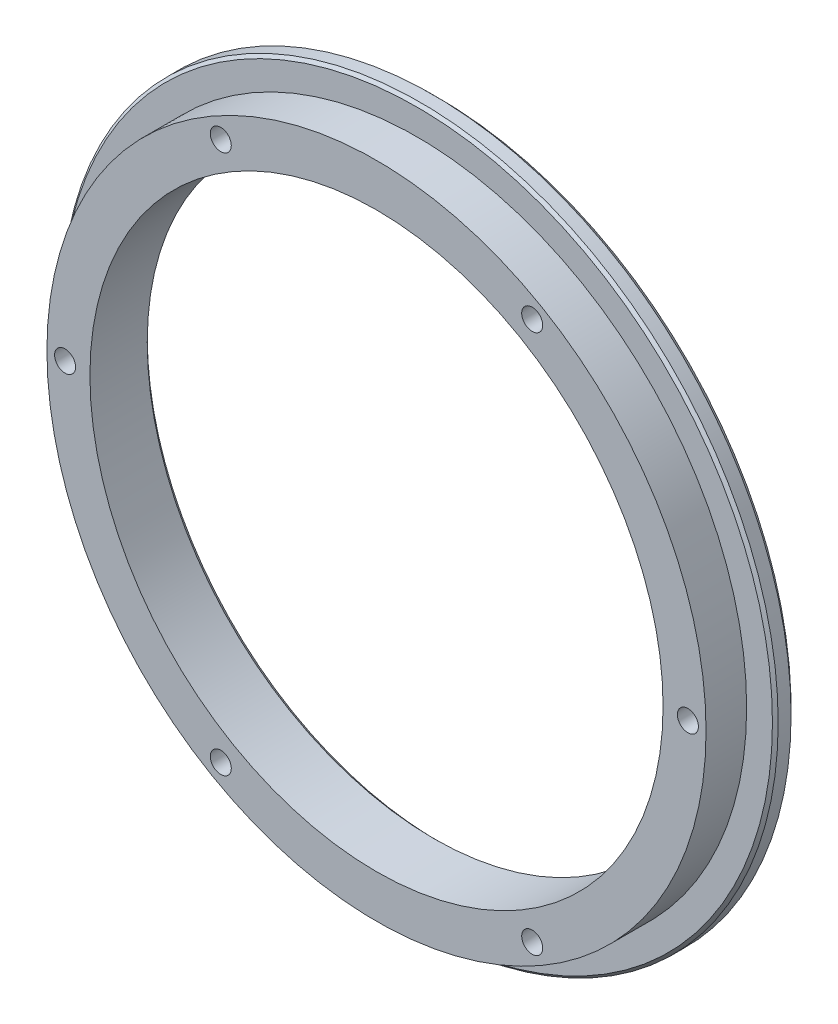
ISO-10303-21;
HEADER;
FILE_DESCRIPTION(('STEP AP214'),'2;1');
FILE_NAME('part.step','',(''),(''),'','','');
FILE_SCHEMA(('AUTOMOTIVE_DESIGN { 1 0 10303 214 1 1 1 1 }'));
ENDSEC;
DATA;
#1=APPLICATION_CONTEXT('core data for automotive mechanical design processes');
#2=APPLICATION_PROTOCOL_DEFINITION('international standard','automotive_design',2000,#1);
#3=PRODUCT_CONTEXT('',#1,'mechanical');
#4=PRODUCT('Part','Part','',(#3));
#5=PRODUCT_RELATED_PRODUCT_CATEGORY('part','',(#4));
#6=PRODUCT_DEFINITION_FORMATION('','',#4);
#7=PRODUCT_DEFINITION_CONTEXT('part definition',#1,'design');
#8=PRODUCT_DEFINITION('design','',#6,#7);
#9=PRODUCT_DEFINITION_SHAPE('','',#8);
#10=(LENGTH_UNIT() NAMED_UNIT(*) SI_UNIT(.MILLI.,.METRE.));
#11=(NAMED_UNIT(*) PLANE_ANGLE_UNIT() SI_UNIT($,.RADIAN.));
#12=(NAMED_UNIT(*) SI_UNIT($,.STERADIAN.) SOLID_ANGLE_UNIT());
#13=UNCERTAINTY_MEASURE_WITH_UNIT(LENGTH_MEASURE(1.E-05),#10,'distance_accuracy_value','');
#14=(GEOMETRIC_REPRESENTATION_CONTEXT(3) GLOBAL_UNCERTAINTY_ASSIGNED_CONTEXT((#13)) GLOBAL_UNIT_ASSIGNED_CONTEXT((#10,
#11,#12)) REPRESENTATION_CONTEXT('',''));
#15=CARTESIAN_POINT('',(0.,0.,0.));
#16=DIRECTION('',(0.,0.,1.));
#17=DIRECTION('',(1.,0.,0.));
#18=AXIS2_PLACEMENT_3D('',#15,#16,#17);
#19=CARTESIAN_POINT('',(0.,0.,-12.7));
#20=DIRECTION('',(0.,0.,1.));
#21=DIRECTION('',(-1.,0.,0.));
#22=AXIS2_PLACEMENT_3D('',#19,#20,#21);
#23=PLANE('',#22);
#24=CARTESIAN_POINT('',(0.,0.,-12.7));
#25=DIRECTION('',(0.,0.,-1.));
#26=DIRECTION('',(-1.,0.,0.));
#27=AXIS2_PLACEMENT_3D('',#24,#25,#26);
#28=CIRCLE('',#27,46.863);
#29=CARTESIAN_POINT('',(-46.863,0.,-12.7));
#30=VERTEX_POINT('',#29);
#31=EDGE_CURVE('E43',#30,#30,#28,.F.);
#32=ORIENTED_EDGE('',*,*,#31,.F.);
#33=EDGE_LOOP('',(#32));
#34=FACE_BOUND('',#33,.T.);
#35=CARTESIAN_POINT('',(0.,0.,-12.7));
#36=DIRECTION('',(0.,0.,-1.));
#37=DIRECTION('',(-1.,0.,0.));
#38=AXIS2_PLACEMENT_3D('',#35,#36,#37);
#39=CIRCLE('',#38,38.735);
#40=CARTESIAN_POINT('',(19.3674999999999,33.5454940155903,-12.7));
#41=VERTEX_POINT('',#40);
#42=CARTESIAN_POINT('',(38.735,0.,-12.7));
#43=VERTEX_POINT('',#42);
#44=EDGE_CURVE('E78',#41,#43,#39,.T.);
#45=ORIENTED_EDGE('',*,*,#44,.F.);
#46=CARTESIAN_POINT('',(20.701,35.8551837674834,-12.7));
#47=DIRECTION('',(0.,0.,1.));
#48=DIRECTION('',(1.,0.,0.));
#49=AXIS2_PLACEMENT_3D('',#46,#47,#48);
#50=CIRCLE('',#49,2.667);
#51=EDGE_CURVE('E256',#41,#41,#50,.T.);
#52=ORIENTED_EDGE('',*,*,#51,.T.);
#53=CARTESIAN_POINT('',(-19.3675000000002,33.5454940155901,-12.7));
#54=VERTEX_POINT('',#53);
#55=EDGE_CURVE('E279',#54,#41,#39,.T.);
#56=ORIENTED_EDGE('',*,*,#55,.F.);
#57=CARTESIAN_POINT('',(-20.701,35.8551837674833,-12.7));
#58=DIRECTION('',(0.,0.,1.));
#59=DIRECTION('',(1.,0.,0.));
#60=AXIS2_PLACEMENT_3D('',#57,#58,#59);
#61=CIRCLE('',#60,2.667);
#62=EDGE_CURVE('E263',#54,#54,#61,.T.);
#63=ORIENTED_EDGE('',*,*,#62,.T.);
#64=CARTESIAN_POINT('',(-38.735,0.,-12.7));
#65=VERTEX_POINT('',#64);
#66=EDGE_CURVE('E107',#65,#54,#39,.T.);
#67=ORIENTED_EDGE('',*,*,#66,.F.);
#68=CARTESIAN_POINT('',(-41.402,0.,-12.7));
#69=DIRECTION('',(0.,0.,1.));
#70=DIRECTION('',(1.,0.,0.));
#71=AXIS2_PLACEMENT_3D('',#68,#69,#70);
#72=CIRCLE('',#71,2.667);
#73=EDGE_CURVE('E270',#65,#65,#72,.T.);
#74=ORIENTED_EDGE('',*,*,#73,.T.);
#75=CARTESIAN_POINT('',(-19.3674999999998,-33.5454940155904,-12.7));
#76=VERTEX_POINT('',#75);
#77=EDGE_CURVE('E74',#76,#65,#39,.T.);
#78=ORIENTED_EDGE('',*,*,#77,.F.);
#79=CARTESIAN_POINT('',(-20.701,-35.8551837674834,-12.7));
#80=DIRECTION('',(0.,0.,1.));
#81=DIRECTION('',(1.,0.,0.));
#82=AXIS2_PLACEMENT_3D('',#79,#80,#81);
#83=CIRCLE('',#82,2.667);
#84=EDGE_CURVE('E80',#76,#76,#83,.T.);
#85=ORIENTED_EDGE('',*,*,#84,.T.);
#86=CARTESIAN_POINT('',(19.3675000000002,-33.5454940155901,-12.7));
#87=VERTEX_POINT('',#86);
#88=EDGE_CURVE('E69',#87,#76,#39,.T.);
#89=ORIENTED_EDGE('',*,*,#88,.F.);
#90=CARTESIAN_POINT('',(20.701,-35.8551837674833,-12.7));
#91=DIRECTION('',(0.,0.,1.));
#92=DIRECTION('',(1.,0.,0.));
#93=AXIS2_PLACEMENT_3D('',#90,#91,#92);
#94=CIRCLE('',#93,2.667);
#95=EDGE_CURVE('E246',#87,#87,#94,.T.);
#96=ORIENTED_EDGE('',*,*,#95,.T.);
#97=EDGE_CURVE('E56',#43,#87,#39,.T.);
#98=ORIENTED_EDGE('',*,*,#97,.F.);
#99=CARTESIAN_POINT('',(41.402,0.,-12.7));
#100=DIRECTION('',(0.,0.,1.));
#101=DIRECTION('',(1.,0.,0.));
#102=AXIS2_PLACEMENT_3D('',#99,#100,#101);
#103=CIRCLE('',#102,2.667);
#104=EDGE_CURVE('E50',#43,#43,#103,.T.);
#105=ORIENTED_EDGE('',*,*,#104,.T.);
#106=EDGE_LOOP('',(#45,#52,#56,#63,#67,#74,#78,#85,#89,#96,#98,#105));
#107=FACE_BOUND('',#106,.T.);
#108=ADVANCED_FACE('F35',(#34,#107),#23,.F.);
#109=CARTESIAN_POINT('',(0.,0.,-4.445));
#110=DIRECTION('',(0.,0.,-1.));
#111=DIRECTION('',(1.,0.,0.));
#112=AXIS2_PLACEMENT_3D('',#109,#110,#111);
#113=CYLINDRICAL_SURFACE('',#112,47.625);
#114=CARTESIAN_POINT('',(0.,0.,-11.938));
#115=DIRECTION('',(0.,0.,-1.));
#116=DIRECTION('',(-1.,0.,0.));
#117=AXIS2_PLACEMENT_3D('',#114,#115,#116);
#118=CIRCLE('',#117,47.625);
#119=CARTESIAN_POINT('',(-47.625,0.,-11.938));
#120=VERTEX_POINT('',#119);
#121=EDGE_CURVE('E11',#120,#120,#118,.T.);
#122=ORIENTED_EDGE('',*,*,#121,.F.);
#123=EDGE_LOOP('',(#122));
#124=FACE_BOUND('',#123,.T.);
#125=CARTESIAN_POINT('',(0.,0.,-10.2235));
#126=DIRECTION('',(0.,0.,1.));
#127=DIRECTION('',(1.,0.,0.));
#128=AXIS2_PLACEMENT_3D('',#125,#126,#127);
#129=CIRCLE('',#128,47.625);
#130=CARTESIAN_POINT('',(47.625,0.,-10.2235));
#131=VERTEX_POINT('',#130);
#132=EDGE_CURVE('E110',#131,#131,#129,.T.);
#133=ORIENTED_EDGE('',*,*,#132,.F.);
#134=EDGE_LOOP('',(#133));
#135=FACE_BOUND('',#134,.T.);
#136=ADVANCED_FACE('F117',(#124,#135),#113,.T.);
#137=CARTESIAN_POINT('',(0.,0.,-4.445));
#138=DIRECTION('',(0.,0.,1.));
#139=DIRECTION('',(-1.,0.,0.));
#140=AXIS2_PLACEMENT_3D('',#137,#138,#139);
#141=PLANE('',#140);
#142=CARTESIAN_POINT('',(41.402,0.,-4.445));
#143=DIRECTION('',(0.,0.,-1.));
#144=DIRECTION('',(-1.,0.,0.));
#145=AXIS2_PLACEMENT_3D('',#142,#143,#144);
#146=CIRCLE('',#145,1.397);
#147=CARTESIAN_POINT('',(40.005,0.,-4.445));
#148=VERTEX_POINT('',#147);
#149=EDGE_CURVE('E176',#148,#148,#146,.T.);
#150=ORIENTED_EDGE('',*,*,#149,.T.);
#151=EDGE_LOOP('',(#150));
#152=FACE_BOUND('',#151,.T.);
#153=CARTESIAN_POINT('',(20.701,-35.8551837674833,-4.445));
#154=DIRECTION('',(0.,0.,-1.));
#155=DIRECTION('',(-1.,0.,0.));
#156=AXIS2_PLACEMENT_3D('',#153,#154,#155);
#157=CIRCLE('',#156,1.397);
#158=CARTESIAN_POINT('',(19.304,-35.8551837674833,-4.445));
#159=VERTEX_POINT('',#158);
#160=EDGE_CURVE('E180',#159,#159,#157,.T.);
#161=ORIENTED_EDGE('',*,*,#160,.T.);
#162=EDGE_LOOP('',(#161));
#163=FACE_BOUND('',#162,.T.);
#164=CARTESIAN_POINT('',(20.701,35.8551837674834,-4.445));
#165=DIRECTION('',(0.,0.,-1.));
#166=DIRECTION('',(-1.,0.,0.));
#167=AXIS2_PLACEMENT_3D('',#164,#165,#166);
#168=CIRCLE('',#167,1.397);
#169=CARTESIAN_POINT('',(19.304,35.8551837674834,-4.445));
#170=VERTEX_POINT('',#169);
#171=EDGE_CURVE('E184',#170,#170,#168,.T.);
#172=ORIENTED_EDGE('',*,*,#171,.T.);
#173=EDGE_LOOP('',(#172));
#174=FACE_BOUND('',#173,.T.);
#175=CARTESIAN_POINT('',(-20.701,35.8551837674833,-4.445));
#176=DIRECTION('',(0.,0.,-1.));
#177=DIRECTION('',(-1.,0.,0.));
#178=AXIS2_PLACEMENT_3D('',#175,#176,#177);
#179=CIRCLE('',#178,1.397);
#180=CARTESIAN_POINT('',(-22.098,35.8551837674833,-4.445));
#181=VERTEX_POINT('',#180);
#182=EDGE_CURVE('E188',#181,#181,#179,.T.);
#183=ORIENTED_EDGE('',*,*,#182,.T.);
#184=EDGE_LOOP('',(#183));
#185=FACE_BOUND('',#184,.T.);
#186=CARTESIAN_POINT('',(-41.402,0.,-4.445));
#187=DIRECTION('',(0.,0.,-1.));
#188=DIRECTION('',(-1.,0.,0.));
#189=AXIS2_PLACEMENT_3D('',#186,#187,#188);
#190=CIRCLE('',#189,1.397);
#191=CARTESIAN_POINT('',(-42.799,0.,-4.445));
#192=VERTEX_POINT('',#191);
#193=EDGE_CURVE('E83',#192,#192,#190,.T.);
#194=ORIENTED_EDGE('',*,*,#193,.T.);
#195=EDGE_LOOP('',(#194));
#196=FACE_BOUND('',#195,.T.);
#197=CARTESIAN_POINT('',(-20.701,-35.8551837674834,-4.445));
#198=DIRECTION('',(0.,0.,-1.));
#199=DIRECTION('',(-1.,0.,0.));
#200=AXIS2_PLACEMENT_3D('',#197,#198,#199);
#201=CIRCLE('',#200,1.397);
#202=CARTESIAN_POINT('',(-22.098,-35.8551837674834,-4.445));
#203=VERTEX_POINT('',#202);
#204=EDGE_CURVE('E86',#203,#203,#201,.T.);
#205=ORIENTED_EDGE('',*,*,#204,.T.);
#206=EDGE_LOOP('',(#205));
#207=FACE_BOUND('',#206,.T.);
#208=CARTESIAN_POINT('',(0.,0.,-4.445));
#209=DIRECTION('',(0.,0.,-1.));
#210=DIRECTION('',(-1.,0.,0.));
#211=AXIS2_PLACEMENT_3D('',#208,#209,#210);
#212=CIRCLE('',#211,43.815);
#213=CARTESIAN_POINT('',(-43.815,0.,-4.445));
#214=VERTEX_POINT('',#213);
#215=EDGE_CURVE('E95',#214,#214,#212,.T.);
#216=ORIENTED_EDGE('',*,*,#215,.F.);
#217=EDGE_LOOP('',(#216));
#218=FACE_BOUND('',#217,.T.);
#219=CARTESIAN_POINT('',(0.,0.,-4.445));
#220=DIRECTION('',(0.,0.,1.));
#221=DIRECTION('',(-1.,0.,0.));
#222=AXIS2_PLACEMENT_3D('',#219,#220,#221);
#223=CIRCLE('',#222,38.1);
#224=CARTESIAN_POINT('',(-38.1,0.,-4.445));
#225=VERTEX_POINT('',#224);
#226=EDGE_CURVE('E101',#225,#225,#223,.T.);
#227=ORIENTED_EDGE('',*,*,#226,.F.);
#228=EDGE_LOOP('',(#227));
#229=FACE_BOUND('',#228,.T.);
#230=ADVANCED_FACE('F122',(#152,#163,#174,#185,#196,#207,#218,#229),#141,.T.);
#231=CARTESIAN_POINT('',(0.,0.,-4.445));
#232=DIRECTION('',(0.,0.,-1.));
#233=DIRECTION('',(1.,0.,0.));
#234=AXIS2_PLACEMENT_3D('',#231,#232,#233);
#235=CYLINDRICAL_SURFACE('',#234,38.1);
#236=CARTESIAN_POINT('',(0.,0.,-12.065));
#237=DIRECTION('',(0.,0.,-1.));
#238=DIRECTION('',(-1.,0.,0.));
#239=AXIS2_PLACEMENT_3D('',#236,#237,#238);
#240=CIRCLE('',#239,38.1);
#241=CARTESIAN_POINT('',(-38.1,0.,-12.065));
#242=VERTEX_POINT('',#241);
#243=EDGE_CURVE('E76',#242,#242,#240,.F.);
#244=ORIENTED_EDGE('',*,*,#243,.F.);
#245=EDGE_LOOP('',(#244));
#246=FACE_BOUND('',#245,.T.);
#247=ORIENTED_EDGE('',*,*,#226,.T.);
#248=EDGE_LOOP('',(#247));
#249=FACE_BOUND('',#248,.T.);
#250=ADVANCED_FACE('F150',(#246,#249),#235,.F.);
#251=CARTESIAN_POINT('',(47.625,0.,-9.8425));
#252=DIRECTION('',(0.,0.,-1.));
#253=DIRECTION('',(1.,0.,0.));
#254=AXIS2_PLACEMENT_3D('',#251,#252,#253);
#255=PLANE('',#254);
#256=CARTESIAN_POINT('',(0.,0.,-9.8425));
#257=DIRECTION('',(0.,0.,1.));
#258=DIRECTION('',(1.,0.,0.));
#259=AXIS2_PLACEMENT_3D('',#256,#257,#258);
#260=CIRCLE('',#259,47.244);
#261=CARTESIAN_POINT('',(47.244,0.,-9.8425));
#262=VERTEX_POINT('',#261);
#263=EDGE_CURVE('E106',#262,#262,#260,.F.);
#264=ORIENTED_EDGE('',*,*,#263,.F.);
#265=EDGE_LOOP('',(#264));
#266=FACE_BOUND('',#265,.T.);
#267=CARTESIAN_POINT('',(0.,0.,-9.8425));
#268=DIRECTION('',(0.,0.,-1.));
#269=DIRECTION('',(-1.,0.,0.));
#270=AXIS2_PLACEMENT_3D('',#267,#268,#269);
#271=CIRCLE('',#270,43.815);
#272=CARTESIAN_POINT('',(-43.815,0.,-9.8425));
#273=VERTEX_POINT('',#272);
#274=EDGE_CURVE('E98',#273,#273,#271,.T.);
#275=ORIENTED_EDGE('',*,*,#274,.T.);
#276=EDGE_LOOP('',(#275));
#277=FACE_BOUND('',#276,.T.);
#278=ADVANCED_FACE('F147',(#266,#277),#255,.F.);
#279=CARTESIAN_POINT('',(0.,0.,-9.8425));
#280=DIRECTION('',(0.,0.,1.));
#281=DIRECTION('',(-1.,0.,0.));
#282=AXIS2_PLACEMENT_3D('',#279,#280,#281);
#283=CYLINDRICAL_SURFACE('',#282,43.815);
#284=ORIENTED_EDGE('',*,*,#215,.T.);
#285=EDGE_LOOP('',(#284));
#286=FACE_BOUND('',#285,.T.);
#287=ORIENTED_EDGE('',*,*,#274,.F.);
#288=EDGE_LOOP('',(#287));
#289=FACE_BOUND('',#288,.T.);
#290=ADVANCED_FACE('F130',(#286,#289),#283,.T.);
#291=CARTESIAN_POINT('',(0.,0.,-12.065));
#292=DIRECTION('',(0.,0.,-1.));
#293=DIRECTION('',(1.,0.,0.));
#294=AXIS2_PLACEMENT_3D('',#291,#292,#293);
#295=CONICAL_SURFACE('',#294,38.1,0.785398163397448);
#296=ORIENTED_EDGE('',*,*,#77,.T.);
#297=ORIENTED_EDGE('',*,*,#66,.T.);
#298=ORIENTED_EDGE('',*,*,#55,.T.);
#299=ORIENTED_EDGE('',*,*,#44,.T.);
#300=ORIENTED_EDGE('',*,*,#97,.T.);
#301=ORIENTED_EDGE('',*,*,#88,.T.);
#302=EDGE_LOOP('',(#296,#297,#298,#299,#300,#301));
#303=FACE_BOUND('',#302,.T.);
#304=ORIENTED_EDGE('',*,*,#243,.T.);
#305=EDGE_LOOP('',(#304));
#306=FACE_BOUND('',#305,.T.);
#307=ADVANCED_FACE('F71',(#303,#306),#295,.F.);
#308=CARTESIAN_POINT('',(-20.701,-35.8551837674834,-12.7));
#309=DIRECTION('',(0.,0.,-1.));
#310=DIRECTION('',(1.,0.,0.));
#311=AXIS2_PLACEMENT_3D('',#308,#309,#310);
#312=CYLINDRICAL_SURFACE('',#311,1.397);
#313=CARTESIAN_POINT('',(-20.701,-35.8551837674834,-11.2390321228293));
#314=DIRECTION('',(0.,0.,1.));
#315=DIRECTION('',(1.,0.,0.));
#316=AXIS2_PLACEMENT_3D('',#313,#314,#315);
#317=CIRCLE('',#316,1.397);
#318=CARTESIAN_POINT('',(-19.304,-35.8551837674834,-11.2390321228293));
#319=VERTEX_POINT('',#318);
#320=EDGE_CURVE('E82',#319,#319,#317,.T.);
#321=ORIENTED_EDGE('',*,*,#320,.F.);
#322=EDGE_LOOP('',(#321));
#323=FACE_BOUND('',#322,.T.);
#324=ORIENTED_EDGE('',*,*,#204,.F.);
#325=EDGE_LOOP('',(#324));
#326=FACE_BOUND('',#325,.T.);
#327=ADVANCED_FACE('F129',(#323,#326),#312,.F.);
#328=CARTESIAN_POINT('',(-20.701,-35.8551837674834,-12.7));
#329=DIRECTION('',(0.,0.,-1.));
#330=DIRECTION('',(1.,0.,0.));
#331=AXIS2_PLACEMENT_3D('',#328,#329,#330);
#332=CONICAL_SURFACE('',#331,2.667,0.715584993317674);
#333=ORIENTED_EDGE('',*,*,#320,.T.);
#334=EDGE_LOOP('',(#333));
#335=FACE_BOUND('',#334,.T.);
#336=ORIENTED_EDGE('',*,*,#84,.F.);
#337=EDGE_LOOP('',(#336));
#338=FACE_BOUND('',#337,.T.);
#339=ADVANCED_FACE('F196',(#335,#338),#332,.F.);
#340=CARTESIAN_POINT('',(-41.402,0.,-12.7));
#341=DIRECTION('',(0.,0.,-1.));
#342=DIRECTION('',(1.,0.,0.));
#343=AXIS2_PLACEMENT_3D('',#340,#341,#342);
#344=CYLINDRICAL_SURFACE('',#343,1.397);
#345=CARTESIAN_POINT('',(-41.402,0.,-11.2390321228293));
#346=DIRECTION('',(0.,0.,1.));
#347=DIRECTION('',(1.,0.,0.));
#348=AXIS2_PLACEMENT_3D('',#345,#346,#347);
#349=CIRCLE('',#348,1.397);
#350=CARTESIAN_POINT('',(-40.005,0.,-11.2390321228293));
#351=VERTEX_POINT('',#350);
#352=EDGE_CURVE('E89',#351,#351,#349,.T.);
#353=ORIENTED_EDGE('',*,*,#352,.F.);
#354=EDGE_LOOP('',(#353));
#355=FACE_BOUND('',#354,.T.);
#356=ORIENTED_EDGE('',*,*,#193,.F.);
#357=EDGE_LOOP('',(#356));
#358=FACE_BOUND('',#357,.T.);
#359=ADVANCED_FACE('F201',(#355,#358),#344,.F.);
#360=CARTESIAN_POINT('',(-41.402,0.,-12.7));
#361=DIRECTION('',(0.,0.,-1.));
#362=DIRECTION('',(1.,0.,0.));
#363=AXIS2_PLACEMENT_3D('',#360,#361,#362);
#364=CONICAL_SURFACE('',#363,2.667,0.715584993317674);
#365=ORIENTED_EDGE('',*,*,#352,.T.);
#366=EDGE_LOOP('',(#365));
#367=FACE_BOUND('',#366,.T.);
#368=ORIENTED_EDGE('',*,*,#73,.F.);
#369=EDGE_LOOP('',(#368));
#370=FACE_BOUND('',#369,.T.);
#371=ADVANCED_FACE('F207',(#367,#370),#364,.F.);
#372=CARTESIAN_POINT('',(-20.701,35.8551837674833,-12.7));
#373=DIRECTION('',(0.,0.,-1.));
#374=DIRECTION('',(1.,0.,0.));
#375=AXIS2_PLACEMENT_3D('',#372,#373,#374);
#376=CYLINDRICAL_SURFACE('',#375,1.397);
#377=CARTESIAN_POINT('',(-20.701,35.8551837674833,-11.2390321228293));
#378=DIRECTION('',(0.,0.,1.));
#379=DIRECTION('',(1.,0.,0.));
#380=AXIS2_PLACEMENT_3D('',#377,#378,#379);
#381=CIRCLE('',#380,1.397);
#382=CARTESIAN_POINT('',(-19.304,35.8551837674833,-11.2390321228293));
#383=VERTEX_POINT('',#382);
#384=EDGE_CURVE('E266',#383,#383,#381,.T.);
#385=ORIENTED_EDGE('',*,*,#384,.F.);
#386=EDGE_LOOP('',(#385));
#387=FACE_BOUND('',#386,.T.);
#388=ORIENTED_EDGE('',*,*,#182,.F.);
#389=EDGE_LOOP('',(#388));
#390=FACE_BOUND('',#389,.T.);
#391=ADVANCED_FACE('F213',(#387,#390),#376,.F.);
#392=CARTESIAN_POINT('',(-20.701,35.8551837674833,-12.7));
#393=DIRECTION('',(0.,0.,-1.));
#394=DIRECTION('',(1.,0.,0.));
#395=AXIS2_PLACEMENT_3D('',#392,#393,#394);
#396=CONICAL_SURFACE('',#395,2.667,0.715584993317674);
#397=ORIENTED_EDGE('',*,*,#384,.T.);
#398=EDGE_LOOP('',(#397));
#399=FACE_BOUND('',#398,.T.);
#400=ORIENTED_EDGE('',*,*,#62,.F.);
#401=EDGE_LOOP('',(#400));
#402=FACE_BOUND('',#401,.T.);
#403=ADVANCED_FACE('F217',(#399,#402),#396,.F.);
#404=CARTESIAN_POINT('',(20.701,35.8551837674834,-12.7));
#405=DIRECTION('',(0.,0.,-1.));
#406=DIRECTION('',(1.,0.,0.));
#407=AXIS2_PLACEMENT_3D('',#404,#405,#406);
#408=CYLINDRICAL_SURFACE('',#407,1.397);
#409=CARTESIAN_POINT('',(20.701,35.8551837674834,-11.2390321228293));
#410=DIRECTION('',(0.,0.,1.));
#411=DIRECTION('',(1.,0.,0.));
#412=AXIS2_PLACEMENT_3D('',#409,#410,#411);
#413=CIRCLE('',#412,1.397);
#414=CARTESIAN_POINT('',(22.098,35.8551837674834,-11.2390321228293));
#415=VERTEX_POINT('',#414);
#416=EDGE_CURVE('E259',#415,#415,#413,.T.);
#417=ORIENTED_EDGE('',*,*,#416,.F.);
#418=EDGE_LOOP('',(#417));
#419=FACE_BOUND('',#418,.T.);
#420=ORIENTED_EDGE('',*,*,#171,.F.);
#421=EDGE_LOOP('',(#420));
#422=FACE_BOUND('',#421,.T.);
#423=ADVANCED_FACE('F221',(#419,#422),#408,.F.);
#424=CARTESIAN_POINT('',(20.701,35.8551837674834,-12.7));
#425=DIRECTION('',(0.,0.,-1.));
#426=DIRECTION('',(1.,0.,0.));
#427=AXIS2_PLACEMENT_3D('',#424,#425,#426);
#428=CONICAL_SURFACE('',#427,2.667,0.715584993317674);
#429=ORIENTED_EDGE('',*,*,#416,.T.);
#430=EDGE_LOOP('',(#429));
#431=FACE_BOUND('',#430,.T.);
#432=ORIENTED_EDGE('',*,*,#51,.F.);
#433=EDGE_LOOP('',(#432));
#434=FACE_BOUND('',#433,.T.);
#435=ADVANCED_FACE('F225',(#431,#434),#428,.F.);
#436=CARTESIAN_POINT('',(20.701,-35.8551837674833,-12.7));
#437=DIRECTION('',(0.,0.,-1.));
#438=DIRECTION('',(1.,0.,0.));
#439=AXIS2_PLACEMENT_3D('',#436,#437,#438);
#440=CYLINDRICAL_SURFACE('',#439,1.397);
#441=CARTESIAN_POINT('',(20.701,-35.8551837674833,-11.2390321228293));
#442=DIRECTION('',(0.,0.,1.));
#443=DIRECTION('',(1.,0.,0.));
#444=AXIS2_PLACEMENT_3D('',#441,#442,#443);
#445=CIRCLE('',#444,1.397);
#446=CARTESIAN_POINT('',(22.098,-35.8551837674833,-11.2390321228293));
#447=VERTEX_POINT('',#446);
#448=EDGE_CURVE('E248',#447,#447,#445,.T.);
#449=ORIENTED_EDGE('',*,*,#448,.F.);
#450=EDGE_LOOP('',(#449));
#451=FACE_BOUND('',#450,.T.);
#452=ORIENTED_EDGE('',*,*,#160,.F.);
#453=EDGE_LOOP('',(#452));
#454=FACE_BOUND('',#453,.T.);
#455=ADVANCED_FACE('F229',(#451,#454),#440,.F.);
#456=CARTESIAN_POINT('',(20.701,-35.8551837674833,-12.7));
#457=DIRECTION('',(0.,0.,-1.));
#458=DIRECTION('',(1.,0.,0.));
#459=AXIS2_PLACEMENT_3D('',#456,#457,#458);
#460=CONICAL_SURFACE('',#459,2.667,0.715584993317674);
#461=ORIENTED_EDGE('',*,*,#448,.T.);
#462=EDGE_LOOP('',(#461));
#463=FACE_BOUND('',#462,.T.);
#464=ORIENTED_EDGE('',*,*,#95,.F.);
#465=EDGE_LOOP('',(#464));
#466=FACE_BOUND('',#465,.T.);
#467=ADVANCED_FACE('F233',(#463,#466),#460,.F.);
#468=CARTESIAN_POINT('',(41.402,0.,-12.7));
#469=DIRECTION('',(0.,0.,-1.));
#470=DIRECTION('',(1.,0.,0.));
#471=AXIS2_PLACEMENT_3D('',#468,#469,#470);
#472=CYLINDRICAL_SURFACE('',#471,1.397);
#473=CARTESIAN_POINT('',(41.402,0.,-11.2390321228293));
#474=DIRECTION('',(0.,0.,1.));
#475=DIRECTION('',(1.,0.,0.));
#476=AXIS2_PLACEMENT_3D('',#473,#474,#475);
#477=CIRCLE('',#476,1.397);
#478=CARTESIAN_POINT('',(42.799,0.,-11.2390321228293));
#479=VERTEX_POINT('',#478);
#480=EDGE_CURVE('E245',#479,#479,#477,.T.);
#481=ORIENTED_EDGE('',*,*,#480,.F.);
#482=EDGE_LOOP('',(#481));
#483=FACE_BOUND('',#482,.T.);
#484=ORIENTED_EDGE('',*,*,#149,.F.);
#485=EDGE_LOOP('',(#484));
#486=FACE_BOUND('',#485,.T.);
#487=ADVANCED_FACE('F140',(#483,#486),#472,.F.);
#488=CARTESIAN_POINT('',(41.402,0.,-12.7));
#489=DIRECTION('',(0.,0.,-1.));
#490=DIRECTION('',(1.,0.,0.));
#491=AXIS2_PLACEMENT_3D('',#488,#489,#490);
#492=CONICAL_SURFACE('',#491,2.667,0.715584993317674);
#493=ORIENTED_EDGE('',*,*,#480,.T.);
#494=EDGE_LOOP('',(#493));
#495=FACE_BOUND('',#494,.T.);
#496=ORIENTED_EDGE('',*,*,#104,.F.);
#497=EDGE_LOOP('',(#496));
#498=FACE_BOUND('',#497,.T.);
#499=ADVANCED_FACE('F133',(#495,#498),#492,.F.);
#500=CARTESIAN_POINT('',(0.,0.,-9.8425));
#501=DIRECTION('',(0.,0.,-1.));
#502=DIRECTION('',(1.,0.,0.));
#503=AXIS2_PLACEMENT_3D('',#500,#501,#502);
#504=CONICAL_SURFACE('',#503,47.244,0.785398163397466);
#505=ORIENTED_EDGE('',*,*,#132,.T.);
#506=EDGE_LOOP('',(#505));
#507=FACE_BOUND('',#506,.T.);
#508=ORIENTED_EDGE('',*,*,#263,.T.);
#509=EDGE_LOOP('',(#508));
#510=FACE_BOUND('',#509,.T.);
#511=ADVANCED_FACE('F131',(#507,#510),#504,.T.);
#512=CARTESIAN_POINT('',(0.,0.,-12.7));
#513=DIRECTION('',(0.,0.,1.));
#514=DIRECTION('',(-1.,0.,0.));
#515=AXIS2_PLACEMENT_3D('',#512,#513,#514);
#516=CONICAL_SURFACE('',#515,46.863,0.785398163397453);
#517=CARTESIAN_POINT('',(-47.625,0.,-11.938));
#518=CARTESIAN_POINT('',(-47.6170625,0.,-11.9459375));
#519=CARTESIAN_POINT('',(-47.609125,0.,-11.953875));
#520=CARTESIAN_POINT('',(-47.59325,0.,-11.96975));
#521=CARTESIAN_POINT('',(-47.5853125,0.,-11.9776875));
#522=CARTESIAN_POINT('',(-47.5694375,0.,-11.9935625));
#523=CARTESIAN_POINT('',(-47.5615,0.,-12.0015));
#524=CARTESIAN_POINT('',(-47.545625,0.,-12.017375));
#525=CARTESIAN_POINT('',(-47.5376875,0.,-12.0253125));
#526=CARTESIAN_POINT('',(-47.5218125,0.,-12.0411875));
#527=CARTESIAN_POINT('',(-47.513875,0.,-12.049125));
#528=CARTESIAN_POINT('',(-47.498,0.,-12.065));
#529=CARTESIAN_POINT('',(-47.4900625,0.,-12.0729375));
#530=CARTESIAN_POINT('',(-47.4741875,0.,-12.0888125));
#531=CARTESIAN_POINT('',(-47.46625,0.,-12.09675));
#532=CARTESIAN_POINT('',(-47.450375,0.,-12.112625));
#533=CARTESIAN_POINT('',(-47.4424375,0.,-12.1205625));
#534=CARTESIAN_POINT('',(-47.4265625,0.,-12.1364375));
#535=CARTESIAN_POINT('',(-47.418625,0.,-12.144375));
#536=CARTESIAN_POINT('',(-47.40275,0.,-12.16025));
#537=CARTESIAN_POINT('',(-47.3948125,0.,-12.1681875));
#538=CARTESIAN_POINT('',(-47.3789375,0.,-12.1840625));
#539=CARTESIAN_POINT('',(-47.371,0.,-12.192));
#540=CARTESIAN_POINT('',(-47.355125,0.,-12.207875));
#541=CARTESIAN_POINT('',(-47.3471875,0.,-12.2158125));
#542=CARTESIAN_POINT('',(-47.3313125,0.,-12.2316875));
#543=CARTESIAN_POINT('',(-47.323375,0.,-12.239625));
#544=CARTESIAN_POINT('',(-47.3075,0.,-12.2555));
#545=CARTESIAN_POINT('',(-47.2995625,0.,-12.2634375));
#546=CARTESIAN_POINT('',(-47.2836875,0.,-12.2793125));
#547=CARTESIAN_POINT('',(-47.27575,0.,-12.28725));
#548=CARTESIAN_POINT('',(-47.259875,0.,-12.303125));
#549=CARTESIAN_POINT('',(-47.2519375,0.,-12.3110625));
#550=CARTESIAN_POINT('',(-47.2360625,0.,-12.3269375));
#551=CARTESIAN_POINT('',(-47.228125,0.,-12.334875));
#552=CARTESIAN_POINT('',(-47.21225,0.,-12.35075));
#553=CARTESIAN_POINT('',(-47.2043125,0.,-12.3586875));
#554=CARTESIAN_POINT('',(-47.1884375,0.,-12.3745625));
#555=CARTESIAN_POINT('',(-47.1805,0.,-12.3825));
#556=CARTESIAN_POINT('',(-47.164625,0.,-12.398375));
#557=CARTESIAN_POINT('',(-47.1566875,0.,-12.4063125));
#558=CARTESIAN_POINT('',(-47.1408125,0.,-12.4221875));
#559=CARTESIAN_POINT('',(-47.132875,0.,-12.430125));
#560=CARTESIAN_POINT('',(-47.117,0.,-12.446));
#561=CARTESIAN_POINT('',(-47.1090625,0.,-12.4539375));
#562=CARTESIAN_POINT('',(-47.0931875,0.,-12.4698125));
#563=CARTESIAN_POINT('',(-47.08525,0.,-12.47775));
#564=CARTESIAN_POINT('',(-47.069375,0.,-12.493625));
#565=CARTESIAN_POINT('',(-47.0614375,0.,-12.5015625));
#566=CARTESIAN_POINT('',(-47.0455625,0.,-12.5174375));
#567=CARTESIAN_POINT('',(-47.037625,0.,-12.525375));
#568=CARTESIAN_POINT('',(-47.02175,0.,-12.54125));
#569=CARTESIAN_POINT('',(-47.0138125,0.,-12.5491875));
#570=CARTESIAN_POINT('',(-46.9979375,0.,-12.5650625));
#571=CARTESIAN_POINT('',(-46.99,0.,-12.573));
#572=CARTESIAN_POINT('',(-46.974125,0.,-12.588875));
#573=CARTESIAN_POINT('',(-46.9661875,0.,-12.5968125));
#574=CARTESIAN_POINT('',(-46.9503125,0.,-12.6126875));
#575=CARTESIAN_POINT('',(-46.942375,0.,-12.620625));
#576=CARTESIAN_POINT('',(-46.9265,0.,-12.6365));
#577=CARTESIAN_POINT('',(-46.9185625,0.,-12.6444375));
#578=CARTESIAN_POINT('',(-46.9026875,0.,-12.6603125));
#579=CARTESIAN_POINT('',(-46.89475,0.,-12.66825));
#580=CARTESIAN_POINT('',(-46.878875,0.,-12.684125));
#581=CARTESIAN_POINT('',(-46.8709375,0.,-12.6920625));
#582=CARTESIAN_POINT('',(-46.863,0.,-12.7));
#583=B_SPLINE_CURVE_WITH_KNOTS('',3,(#517,#518,#519,#520,#521,#522,#523,#524,#525,#526,#527,
#528,#529,#530,#531,#532,#533,#534,#535,#536,#537,#538,#539,#540,#541,#542,#543,#544,#545,#546,
#547,#548,#549,#550,#551,#552,#553,#554,#555,#556,#557,#558,#559,#560,#561,#562,#563,#564,#565,
#566,#567,#568,#569,#570,#571,#572,#573,#574,#575,#576,#577,#578,#579,#580,#581,#582),
.UNSPECIFIED.,.F.,.F.,(4,2,2,2,2,2,2,2,2,2,2,2,2,2,2,2,2,2,2,2,2,2,2,2,2,2,2,2,2,2,2,2,4),(0.,
0.0336759604540087,0.067351920908021,0.10102788136203,0.134703841816037,0.168379802270051,
0.202055762724058,0.235731723178072,0.269407683632079,0.303083644086093,0.3367596045401,
0.370435564994109,0.404111525448121,0.43778748590213,0.471463446356142,0.505139406810151,
0.538815367264158,0.572491327718172,0.606167288172179,0.639843248626193,0.6735192090802,
0.707195169534209,0.740871129988221,0.77454709044223,0.808223050896243,0.841899011350251,
0.875574971804259,0.909250932258272,0.94292689271228,0.976602853166293,1.0102788136203,
1.04395477407431,1.07763073452832),.UNSPECIFIED.);
#584=EDGE_CURVE('BSEAM37',#120,#30,#583,.T.);
#585=ORIENTED_EDGE('',*,*,#121,.T.);
#586=ORIENTED_EDGE('',*,*,#31,.T.);
#587=ORIENTED_EDGE('',*,*,#584,.T.);
#588=ORIENTED_EDGE('',*,*,#584,.F.);
#589=EDGE_LOOP('',(#585,#587,#586,#588));
#590=FACE_BOUND('',#589,.T.);
#591=ADVANCED_FACE('F37',(#590),#516,.T.);
#592=CLOSED_SHELL('',(#108,#136,#230,#250,#278,#290,#307,#327,#339,#359,#371,#391,#403,#423,
#435,#455,#467,#487,#499,#511,#591));
#593=MANIFOLD_SOLID_BREP('B2',#592);
#594=ADVANCED_BREP_SHAPE_REPRESENTATION('',(#18,#593),#14);
#595=SHAPE_DEFINITION_REPRESENTATION(#9,#594);
ENDSEC;
END-ISO-10303-21;
